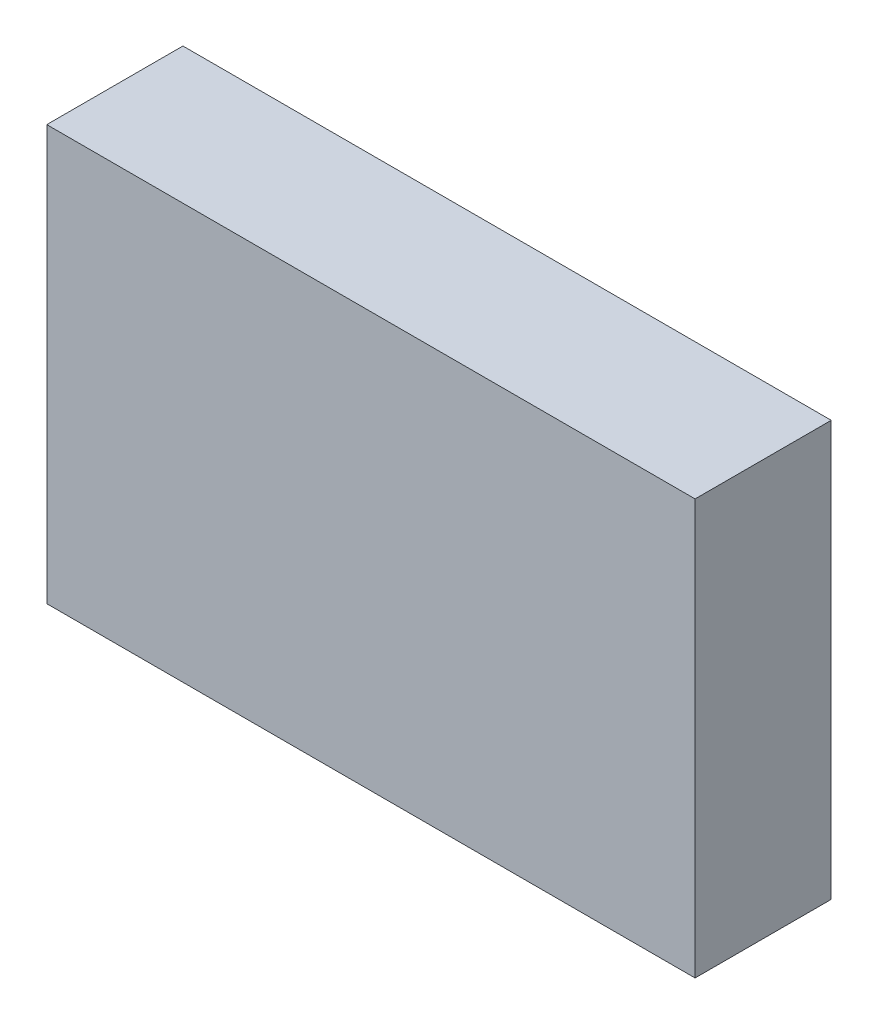
ISO-10303-21;
HEADER;
FILE_DESCRIPTION(('STEP AP214'),'2;1');
FILE_NAME('part.step','',(''),(''),'','','');
FILE_SCHEMA(('AUTOMOTIVE_DESIGN { 1 0 10303 214 1 1 1 1 }'));
ENDSEC;
DATA;
#1=APPLICATION_CONTEXT('core data for automotive mechanical design processes');
#2=APPLICATION_PROTOCOL_DEFINITION('international standard','automotive_design',2000,#1);
#3=PRODUCT_CONTEXT('',#1,'mechanical');
#4=PRODUCT('Part','Part','',(#3));
#5=PRODUCT_RELATED_PRODUCT_CATEGORY('part','',(#4));
#6=PRODUCT_DEFINITION_FORMATION('','',#4);
#7=PRODUCT_DEFINITION_CONTEXT('part definition',#1,'design');
#8=PRODUCT_DEFINITION('design','',#6,#7);
#9=PRODUCT_DEFINITION_SHAPE('','',#8);
#10=(LENGTH_UNIT() NAMED_UNIT(*) SI_UNIT(.MILLI.,.METRE.));
#11=(NAMED_UNIT(*) PLANE_ANGLE_UNIT() SI_UNIT($,.RADIAN.));
#12=(NAMED_UNIT(*) SI_UNIT($,.STERADIAN.) SOLID_ANGLE_UNIT());
#13=UNCERTAINTY_MEASURE_WITH_UNIT(LENGTH_MEASURE(1.E-05),#10,'distance_accuracy_value','');
#14=(GEOMETRIC_REPRESENTATION_CONTEXT(3) GLOBAL_UNCERTAINTY_ASSIGNED_CONTEXT((#13)) GLOBAL_UNIT_ASSIGNED_CONTEXT((#10,
#11,#12)) REPRESENTATION_CONTEXT('',''));
#15=CARTESIAN_POINT('',(0.,0.,0.));
#16=DIRECTION('',(0.,0.,1.));
#17=DIRECTION('',(1.,0.,0.));
#18=AXIS2_PLACEMENT_3D('',#15,#16,#17);
#19=CARTESIAN_POINT('',(-2.50000008,1.59999934,1.05000044));
#20=DIRECTION('',(0.,0.,1.));
#21=DIRECTION('',(1.,0.,0.));
#22=AXIS2_PLACEMENT_3D('',#19,#20,#21);
#23=PLANE('',#22);
#24=DIRECTION('',(0.,1.,0.));
#25=VECTOR('',#24,1.);
#26=CARTESIAN_POINT('',(2.50000008,1.59999934,1.05000044));
#27=LINE('',#26,#25);
#28=CARTESIAN_POINT('',(2.50000008,1.59999934,1.05000044));
#29=VERTEX_POINT('',#28);
#30=CARTESIAN_POINT('',(2.50000008,-1.59999934,1.05000044));
#31=VERTEX_POINT('',#30);
#32=EDGE_CURVE('E53',#29,#31,#27,.F.);
#33=ORIENTED_EDGE('',*,*,#32,.F.);
#34=DIRECTION('',(1.,0.,0.));
#35=VECTOR('',#34,1.);
#36=CARTESIAN_POINT('',(-2.50000008,1.59999934,1.05000044));
#37=LINE('',#36,#35);
#38=CARTESIAN_POINT('',(-2.50000008,1.59999934,1.05000044));
#39=VERTEX_POINT('',#38);
#40=EDGE_CURVE('E68',#39,#29,#37,.T.);
#41=ORIENTED_EDGE('',*,*,#40,.F.);
#42=DIRECTION('',(0.,1.,0.));
#43=VECTOR('',#42,1.);
#44=CARTESIAN_POINT('',(-2.50000008,-1.59999934,1.05000044));
#45=LINE('',#44,#43);
#46=CARTESIAN_POINT('',(-2.50000008,-1.59999934,1.05000044));
#47=VERTEX_POINT('',#46);
#48=EDGE_CURVE('E20',#47,#39,#45,.T.);
#49=ORIENTED_EDGE('',*,*,#48,.F.);
#50=DIRECTION('',(1.,0.,0.));
#51=VECTOR('',#50,1.);
#52=CARTESIAN_POINT('',(2.50000008,-1.59999934,1.05000044));
#53=LINE('',#52,#51);
#54=EDGE_CURVE('E58',#31,#47,#53,.F.);
#55=ORIENTED_EDGE('',*,*,#54,.F.);
#56=EDGE_LOOP('',(#33,#41,#49,#55));
#57=FACE_BOUND('',#56,.T.);
#58=ADVANCED_FACE('F17',(#57),#23,.T.);
#59=CARTESIAN_POINT('',(-2.50000008,-1.59999934,0.));
#60=DIRECTION('',(-1.,0.,0.));
#61=DIRECTION('',(0.,0.,1.));
#62=AXIS2_PLACEMENT_3D('',#59,#60,#61);
#63=PLANE('',#62);
#64=DIRECTION('',(0.,0.,1.));
#65=VECTOR('',#64,1.);
#66=CARTESIAN_POINT('',(-2.50000008,1.59999934,0.));
#67=LINE('',#66,#65);
#68=CARTESIAN_POINT('',(-2.50000008,1.59999934,0.));
#69=VERTEX_POINT('',#68);
#70=EDGE_CURVE('E79',#69,#39,#67,.T.);
#71=ORIENTED_EDGE('',*,*,#70,.F.);
#72=DIRECTION('',(0.,1.,0.));
#73=VECTOR('',#72,1.);
#74=CARTESIAN_POINT('',(-2.50000008,1.59999934,0.));
#75=LINE('',#74,#73);
#76=CARTESIAN_POINT('',(-2.50000008,-1.59999934,0.));
#77=VERTEX_POINT('',#76);
#78=EDGE_CURVE('E74',#69,#77,#75,.F.);
#79=ORIENTED_EDGE('',*,*,#78,.T.);
#80=DIRECTION('',(0.,0.,-1.));
#81=VECTOR('',#80,1.);
#82=CARTESIAN_POINT('',(-2.50000008,-1.59999934,0.));
#83=LINE('',#82,#81);
#84=EDGE_CURVE('E63',#47,#77,#83,.T.);
#85=ORIENTED_EDGE('',*,*,#84,.F.);
#86=ORIENTED_EDGE('',*,*,#48,.T.);
#87=EDGE_LOOP('',(#71,#79,#85,#86));
#88=FACE_BOUND('',#87,.T.);
#89=ADVANCED_FACE('F73',(#88),#63,.T.);
#90=CARTESIAN_POINT('',(2.50000008,-1.59999934,0.));
#91=DIRECTION('',(0.,-1.,0.));
#92=DIRECTION('',(0.,0.,-1.));
#93=AXIS2_PLACEMENT_3D('',#90,#91,#92);
#94=PLANE('',#93);
#95=ORIENTED_EDGE('',*,*,#84,.T.);
#96=DIRECTION('',(1.,0.,0.));
#97=VECTOR('',#96,1.);
#98=CARTESIAN_POINT('',(-2.50000008,-1.59999934,0.));
#99=LINE('',#98,#97);
#100=CARTESIAN_POINT('',(2.50000008,-1.59999934,0.));
#101=VERTEX_POINT('',#100);
#102=EDGE_CURVE('E84',#77,#101,#99,.T.);
#103=ORIENTED_EDGE('',*,*,#102,.T.);
#104=DIRECTION('',(0.,0.,-1.));
#105=VECTOR('',#104,1.);
#106=CARTESIAN_POINT('',(2.50000008,-1.59999934,0.));
#107=LINE('',#106,#105);
#108=EDGE_CURVE('E65',#31,#101,#107,.T.);
#109=ORIENTED_EDGE('',*,*,#108,.F.);
#110=ORIENTED_EDGE('',*,*,#54,.T.);
#111=EDGE_LOOP('',(#95,#103,#109,#110));
#112=FACE_BOUND('',#111,.T.);
#113=ADVANCED_FACE('F60',(#112),#94,.T.);
#114=CARTESIAN_POINT('',(2.50000008,1.59999934,0.));
#115=DIRECTION('',(1.,0.,0.));
#116=DIRECTION('',(0.,0.,-1.));
#117=AXIS2_PLACEMENT_3D('',#114,#115,#116);
#118=PLANE('',#117);
#119=ORIENTED_EDGE('',*,*,#108,.T.);
#120=DIRECTION('',(0.,1.,0.));
#121=VECTOR('',#120,1.);
#122=CARTESIAN_POINT('',(2.50000008,1.59999934,0.));
#123=LINE('',#122,#121);
#124=CARTESIAN_POINT('',(2.50000008,1.59999934,0.));
#125=VERTEX_POINT('',#124);
#126=EDGE_CURVE('E26',#101,#125,#123,.T.);
#127=ORIENTED_EDGE('',*,*,#126,.T.);
#128=DIRECTION('',(0.,0.,1.));
#129=VECTOR('',#128,1.);
#130=CARTESIAN_POINT('',(2.50000008,1.59999934,0.));
#131=LINE('',#130,#129);
#132=EDGE_CURVE('E34',#29,#125,#131,.F.);
#133=ORIENTED_EDGE('',*,*,#132,.F.);
#134=ORIENTED_EDGE('',*,*,#32,.T.);
#135=EDGE_LOOP('',(#119,#127,#133,#134));
#136=FACE_BOUND('',#135,.T.);
#137=ADVANCED_FACE('F88',(#136),#118,.T.);
#138=CARTESIAN_POINT('',(-2.50000008,1.59999934,0.));
#139=DIRECTION('',(0.,1.,0.));
#140=DIRECTION('',(0.,0.,1.));
#141=AXIS2_PLACEMENT_3D('',#138,#139,#140);
#142=PLANE('',#141);
#143=ORIENTED_EDGE('',*,*,#132,.T.);
#144=DIRECTION('',(1.,0.,0.));
#145=VECTOR('',#144,1.);
#146=CARTESIAN_POINT('',(-2.50000008,1.59999934,0.));
#147=LINE('',#146,#145);
#148=EDGE_CURVE('E11',#125,#69,#147,.F.);
#149=ORIENTED_EDGE('',*,*,#148,.T.);
#150=ORIENTED_EDGE('',*,*,#70,.T.);
#151=ORIENTED_EDGE('',*,*,#40,.T.);
#152=EDGE_LOOP('',(#143,#149,#150,#151));
#153=FACE_BOUND('',#152,.T.);
#154=ADVANCED_FACE('F91',(#153),#142,.T.);
#155=CARTESIAN_POINT('',(-2.50000008,1.59999934,0.));
#156=DIRECTION('',(0.,0.,1.));
#157=DIRECTION('',(1.,0.,0.));
#158=AXIS2_PLACEMENT_3D('',#155,#156,#157);
#159=PLANE('',#158);
#160=ORIENTED_EDGE('',*,*,#126,.F.);
#161=ORIENTED_EDGE('',*,*,#102,.F.);
#162=ORIENTED_EDGE('',*,*,#78,.F.);
#163=ORIENTED_EDGE('',*,*,#148,.F.);
#164=EDGE_LOOP('',(#160,#161,#162,#163));
#165=FACE_BOUND('',#164,.T.);
#166=ADVANCED_FACE('F90',(#165),#159,.F.);
#167=CLOSED_SHELL('',(#58,#89,#113,#137,#154,#166));
#168=MANIFOLD_SOLID_BREP('B1',#167);
#169=ADVANCED_BREP_SHAPE_REPRESENTATION('',(#18,#168),#14);
#170=SHAPE_DEFINITION_REPRESENTATION(#9,#169);
ENDSEC;
END-ISO-10303-21;
